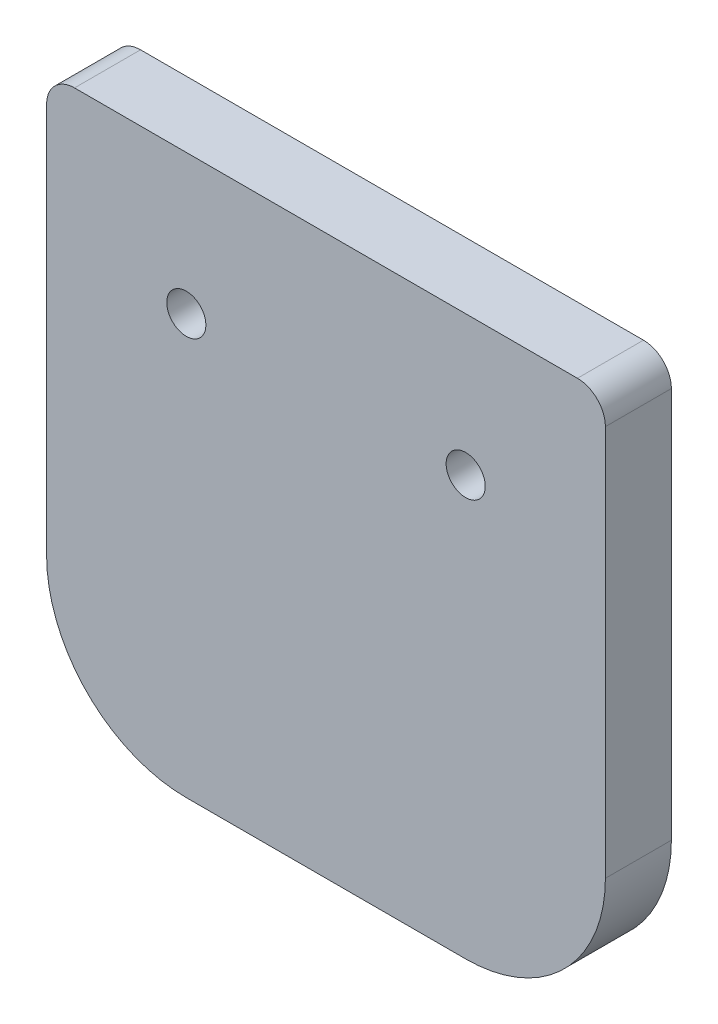
ISO-10303-21;
HEADER;
FILE_DESCRIPTION(('STEP AP214'),'2;1');
FILE_NAME('part.step','',(''),(''),'','','');
FILE_SCHEMA(('AUTOMOTIVE_DESIGN { 1 0 10303 214 1 1 1 1 }'));
ENDSEC;
DATA;
#1=APPLICATION_CONTEXT('core data for automotive mechanical design processes');
#2=APPLICATION_PROTOCOL_DEFINITION('international standard','automotive_design',2000,#1);
#3=PRODUCT_CONTEXT('',#1,'mechanical');
#4=PRODUCT('Part','Part','',(#3));
#5=PRODUCT_RELATED_PRODUCT_CATEGORY('part','',(#4));
#6=PRODUCT_DEFINITION_FORMATION('','',#4);
#7=PRODUCT_DEFINITION_CONTEXT('part definition',#1,'design');
#8=PRODUCT_DEFINITION('design','',#6,#7);
#9=PRODUCT_DEFINITION_SHAPE('','',#8);
#10=(LENGTH_UNIT() NAMED_UNIT(*) SI_UNIT(.MILLI.,.METRE.));
#11=(NAMED_UNIT(*) PLANE_ANGLE_UNIT() SI_UNIT($,.RADIAN.));
#12=(NAMED_UNIT(*) SI_UNIT($,.STERADIAN.) SOLID_ANGLE_UNIT());
#13=UNCERTAINTY_MEASURE_WITH_UNIT(LENGTH_MEASURE(1.E-05),#10,'distance_accuracy_value','');
#14=(GEOMETRIC_REPRESENTATION_CONTEXT(3) GLOBAL_UNCERTAINTY_ASSIGNED_CONTEXT((#13)) GLOBAL_UNIT_ASSIGNED_CONTEXT((#10,
#11,#12)) REPRESENTATION_CONTEXT('',''));
#15=CARTESIAN_POINT('',(0.,0.,0.));
#16=DIRECTION('',(0.,0.,1.));
#17=DIRECTION('',(1.,0.,0.));
#18=AXIS2_PLACEMENT_3D('',#15,#16,#17);
#19=CARTESIAN_POINT('',(25.4,22.86,0.));
#20=DIRECTION('',(-1.,0.,0.));
#21=DIRECTION('',(0.,-1.,0.));
#22=AXIS2_PLACEMENT_3D('',#19,#20,#21);
#23=PLANE('',#22);
#24=DIRECTION('',(0.,0.,1.));
#25=VECTOR('',#24,1.);
#26=CARTESIAN_POINT('',(25.4,-12.7000000052096,3.));
#27=LINE('',#26,#25);
#28=CARTESIAN_POINT('',(25.4,-12.7000000026048,6.));
#29=VERTEX_POINT('',#28);
#30=CARTESIAN_POINT('',(25.4,-12.7000000026048,0.));
#31=VERTEX_POINT('',#30);
#32=EDGE_CURVE('E111',#29,#31,#27,.F.);
#33=ORIENTED_EDGE('',*,*,#32,.T.);
#34=DIRECTION('',(0.,1.,0.));
#35=VECTOR('',#34,1.);
#36=CARTESIAN_POINT('',(25.4,0.,0.));
#37=LINE('',#36,#35);
#38=CARTESIAN_POINT('',(25.4,22.859999999479,0.));
#39=VERTEX_POINT('',#38);
#40=EDGE_CURVE('E106',#31,#39,#37,.T.);
#41=ORIENTED_EDGE('',*,*,#40,.T.);
#42=DIRECTION('',(0.,0.,-1.));
#43=VECTOR('',#42,1.);
#44=CARTESIAN_POINT('',(25.4,22.8599999989581,3.));
#45=LINE('',#44,#43);
#46=CARTESIAN_POINT('',(25.4,22.859999999479,6.));
#47=VERTEX_POINT('',#46);
#48=EDGE_CURVE('E81',#39,#47,#45,.F.);
#49=ORIENTED_EDGE('',*,*,#48,.T.);
#50=DIRECTION('',(0.,1.,0.));
#51=VECTOR('',#50,1.);
#52=CARTESIAN_POINT('',(25.4,0.,6.));
#53=LINE('',#52,#51);
#54=EDGE_CURVE('E139',#29,#47,#53,.T.);
#55=ORIENTED_EDGE('',*,*,#54,.F.);
#56=EDGE_LOOP('',(#33,#41,#49,#55));
#57=FACE_BOUND('',#56,.T.);
#58=ADVANCED_FACE('F17',(#57),#23,.F.);
#59=CARTESIAN_POINT('',(22.86,22.86,6.));
#60=DIRECTION('',(0.,0.,-1.));
#61=DIRECTION('',(-1.,0.,0.));
#62=AXIS2_PLACEMENT_3D('',#59,#60,#61);
#63=CYLINDRICAL_SURFACE('',#62,2.54);
#64=CARTESIAN_POINT('',(22.86,22.86,0.));
#65=DIRECTION('',(0.,0.,-1.));
#66=DIRECTION('',(-1.,0.,0.));
#67=AXIS2_PLACEMENT_3D('',#64,#65,#66);
#68=CIRCLE('',#67,2.54);
#69=CARTESIAN_POINT('',(22.86,25.4,0.));
#70=VERTEX_POINT('',#69);
#71=EDGE_CURVE('E21',#39,#70,#68,.F.);
#72=ORIENTED_EDGE('',*,*,#71,.T.);
#73=DIRECTION('',(0.,0.,1.));
#74=VECTOR('',#73,1.);
#75=CARTESIAN_POINT('',(22.86,25.4,3.));
#76=LINE('',#75,#74);
#77=CARTESIAN_POINT('',(22.86,25.4,6.));
#78=VERTEX_POINT('',#77);
#79=EDGE_CURVE('E88',#70,#78,#76,.T.);
#80=ORIENTED_EDGE('',*,*,#79,.T.);
#81=CARTESIAN_POINT('',(22.86,22.86,6.));
#82=DIRECTION('',(0.,0.,-1.));
#83=DIRECTION('',(-1.,0.,0.));
#84=AXIS2_PLACEMENT_3D('',#81,#82,#83);
#85=CIRCLE('',#84,2.54);
#86=EDGE_CURVE('E137',#47,#78,#85,.F.);
#87=ORIENTED_EDGE('',*,*,#86,.F.);
#88=ORIENTED_EDGE('',*,*,#48,.F.);
#89=EDGE_LOOP('',(#72,#80,#87,#88));
#90=FACE_BOUND('',#89,.T.);
#91=ADVANCED_FACE('F105',(#90),#63,.T.);
#92=CARTESIAN_POINT('',(-22.86,25.4,0.));
#93=DIRECTION('',(0.,-1.,0.));
#94=DIRECTION('',(1.,0.,0.));
#95=AXIS2_PLACEMENT_3D('',#92,#93,#94);
#96=PLANE('',#95);
#97=ORIENTED_EDGE('',*,*,#79,.F.);
#98=DIRECTION('',(-1.,0.,0.));
#99=VECTOR('',#98,1.);
#100=CARTESIAN_POINT('',(0.,25.4,0.));
#101=LINE('',#100,#99);
#102=CARTESIAN_POINT('',(-22.8599999997395,25.4,0.));
#103=VERTEX_POINT('',#102);
#104=EDGE_CURVE('E92',#70,#103,#101,.T.);
#105=ORIENTED_EDGE('',*,*,#104,.T.);
#106=DIRECTION('',(0.,0.,-1.));
#107=VECTOR('',#106,1.);
#108=CARTESIAN_POINT('',(-22.859999999479,25.4,3.));
#109=LINE('',#108,#107);
#110=CARTESIAN_POINT('',(-22.8599999997395,25.4,6.));
#111=VERTEX_POINT('',#110);
#112=EDGE_CURVE('E94',#103,#111,#109,.F.);
#113=ORIENTED_EDGE('',*,*,#112,.T.);
#114=DIRECTION('',(-1.,0.,0.));
#115=VECTOR('',#114,1.);
#116=CARTESIAN_POINT('',(0.,25.4,6.));
#117=LINE('',#116,#115);
#118=EDGE_CURVE('E93',#78,#111,#117,.T.);
#119=ORIENTED_EDGE('',*,*,#118,.F.);
#120=EDGE_LOOP('',(#97,#105,#113,#119));
#121=FACE_BOUND('',#120,.T.);
#122=ADVANCED_FACE('F90',(#121),#96,.F.);
#123=CARTESIAN_POINT('',(-22.86,22.86,6.));
#124=DIRECTION('',(0.,0.,-1.));
#125=DIRECTION('',(-1.,0.,0.));
#126=AXIS2_PLACEMENT_3D('',#123,#124,#125);
#127=CYLINDRICAL_SURFACE('',#126,2.54);
#128=CARTESIAN_POINT('',(-22.86,22.86,0.));
#129=DIRECTION('',(0.,0.,-1.));
#130=DIRECTION('',(-1.,0.,0.));
#131=AXIS2_PLACEMENT_3D('',#128,#129,#130);
#132=CIRCLE('',#131,2.54);
#133=CARTESIAN_POINT('',(-25.4,22.86,0.));
#134=VERTEX_POINT('',#133);
#135=EDGE_CURVE('E103',#103,#134,#132,.F.);
#136=ORIENTED_EDGE('',*,*,#135,.T.);
#137=DIRECTION('',(0.,0.,-1.));
#138=VECTOR('',#137,1.);
#139=CARTESIAN_POINT('',(-25.4,22.86,3.));
#140=LINE('',#139,#138);
#141=CARTESIAN_POINT('',(-25.4,22.86,6.));
#142=VERTEX_POINT('',#141);
#143=EDGE_CURVE('E121',#142,#134,#140,.T.);
#144=ORIENTED_EDGE('',*,*,#143,.F.);
#145=CARTESIAN_POINT('',(-22.86,22.86,6.));
#146=DIRECTION('',(0.,0.,-1.));
#147=DIRECTION('',(-1.,0.,0.));
#148=AXIS2_PLACEMENT_3D('',#145,#146,#147);
#149=CIRCLE('',#148,2.54);
#150=EDGE_CURVE('E135',#111,#142,#149,.F.);
#151=ORIENTED_EDGE('',*,*,#150,.F.);
#152=ORIENTED_EDGE('',*,*,#112,.F.);
#153=EDGE_LOOP('',(#136,#144,#151,#152));
#154=FACE_BOUND('',#153,.T.);
#155=ADVANCED_FACE('F175',(#154),#127,.T.);
#156=CARTESIAN_POINT('',(-25.4,22.86,0.));
#157=DIRECTION('',(-1.,0.,0.));
#158=DIRECTION('',(0.,-1.,0.));
#159=AXIS2_PLACEMENT_3D('',#156,#157,#158);
#160=PLANE('',#159);
#161=DIRECTION('',(0.,0.,-1.));
#162=VECTOR('',#161,1.);
#163=CARTESIAN_POINT('',(-25.4,-12.7000000022808,3.));
#164=LINE('',#163,#162);
#165=CARTESIAN_POINT('',(-25.4,-12.7000000011404,0.));
#166=VERTEX_POINT('',#165);
#167=CARTESIAN_POINT('',(-25.4,-12.7000000011404,6.));
#168=VERTEX_POINT('',#167);
#169=EDGE_CURVE('E118',#166,#168,#164,.F.);
#170=ORIENTED_EDGE('',*,*,#169,.T.);
#171=DIRECTION('',(0.,-1.,0.));
#172=VECTOR('',#171,1.);
#173=CARTESIAN_POINT('',(-25.4,0.,6.));
#174=LINE('',#173,#172);
#175=EDGE_CURVE('E134',#142,#168,#174,.T.);
#176=ORIENTED_EDGE('',*,*,#175,.F.);
#177=ORIENTED_EDGE('',*,*,#143,.T.);
#178=DIRECTION('',(0.,-1.,0.));
#179=VECTOR('',#178,1.);
#180=CARTESIAN_POINT('',(-25.4,0.,0.));
#181=LINE('',#180,#179);
#182=EDGE_CURVE('E149',#134,#166,#181,.T.);
#183=ORIENTED_EDGE('',*,*,#182,.T.);
#184=EDGE_LOOP('',(#170,#176,#177,#183));
#185=FACE_BOUND('',#184,.T.);
#186=ADVANCED_FACE('F164',(#185),#160,.T.);
#187=CARTESIAN_POINT('',(-12.7,-12.7,6.));
#188=DIRECTION('',(0.,0.,-1.));
#189=DIRECTION('',(-1.,0.,0.));
#190=AXIS2_PLACEMENT_3D('',#187,#188,#189);
#191=CYLINDRICAL_SURFACE('',#190,12.7);
#192=CARTESIAN_POINT('',(-12.7,-12.7,0.));
#193=DIRECTION('',(0.,0.,-1.));
#194=DIRECTION('',(-1.,0.,0.));
#195=AXIS2_PLACEMENT_3D('',#192,#193,#194);
#196=CIRCLE('',#195,12.7);
#197=CARTESIAN_POINT('',(-12.7,-25.4,0.));
#198=VERTEX_POINT('',#197);
#199=EDGE_CURVE('E147',#166,#198,#196,.F.);
#200=ORIENTED_EDGE('',*,*,#199,.T.);
#201=DIRECTION('',(0.,0.,-1.));
#202=VECTOR('',#201,1.);
#203=CARTESIAN_POINT('',(-12.7,-25.4,3.));
#204=LINE('',#203,#202);
#205=CARTESIAN_POINT('',(-12.7,-25.4,6.));
#206=VERTEX_POINT('',#205);
#207=EDGE_CURVE('E116',#206,#198,#204,.T.);
#208=ORIENTED_EDGE('',*,*,#207,.F.);
#209=CARTESIAN_POINT('',(-12.7,-12.7,6.));
#210=DIRECTION('',(0.,0.,-1.));
#211=DIRECTION('',(-1.,0.,0.));
#212=AXIS2_PLACEMENT_3D('',#209,#210,#211);
#213=CIRCLE('',#212,12.7);
#214=EDGE_CURVE('E132',#168,#206,#213,.F.);
#215=ORIENTED_EDGE('',*,*,#214,.F.);
#216=ORIENTED_EDGE('',*,*,#169,.F.);
#217=EDGE_LOOP('',(#200,#208,#215,#216));
#218=FACE_BOUND('',#217,.T.);
#219=ADVANCED_FACE('F167',(#218),#191,.T.);
#220=CARTESIAN_POINT('',(-12.7,-25.4,0.));
#221=DIRECTION('',(0.,-1.,0.));
#222=DIRECTION('',(1.,0.,0.));
#223=AXIS2_PLACEMENT_3D('',#220,#221,#222);
#224=PLANE('',#223);
#225=DIRECTION('',(0.,0.,-1.));
#226=VECTOR('',#225,1.);
#227=CARTESIAN_POINT('',(12.7000000048856,-25.4,3.));
#228=LINE('',#227,#226);
#229=CARTESIAN_POINT('',(12.7000000024428,-25.4,0.));
#230=VERTEX_POINT('',#229);
#231=CARTESIAN_POINT('',(12.7000000024428,-25.4,6.));
#232=VERTEX_POINT('',#231);
#233=EDGE_CURVE('E107',#230,#232,#228,.F.);
#234=ORIENTED_EDGE('',*,*,#233,.T.);
#235=DIRECTION('',(1.,0.,0.));
#236=VECTOR('',#235,1.);
#237=CARTESIAN_POINT('',(0.,-25.4,6.));
#238=LINE('',#237,#236);
#239=EDGE_CURVE('E36',#206,#232,#238,.T.);
#240=ORIENTED_EDGE('',*,*,#239,.F.);
#241=ORIENTED_EDGE('',*,*,#207,.T.);
#242=DIRECTION('',(1.,0.,0.));
#243=VECTOR('',#242,1.);
#244=CARTESIAN_POINT('',(0.,-25.4,0.));
#245=LINE('',#244,#243);
#246=EDGE_CURVE('E146',#198,#230,#245,.T.);
#247=ORIENTED_EDGE('',*,*,#246,.T.);
#248=EDGE_LOOP('',(#234,#240,#241,#247));
#249=FACE_BOUND('',#248,.T.);
#250=ADVANCED_FACE('F169',(#249),#224,.T.);
#251=CARTESIAN_POINT('',(12.7,-12.7,6.));
#252=DIRECTION('',(0.,0.,-1.));
#253=DIRECTION('',(-1.,0.,0.));
#254=AXIS2_PLACEMENT_3D('',#251,#252,#253);
#255=CYLINDRICAL_SURFACE('',#254,12.7);
#256=CARTESIAN_POINT('',(12.7,-12.7,0.));
#257=DIRECTION('',(0.,0.,-1.));
#258=DIRECTION('',(-1.,0.,0.));
#259=AXIS2_PLACEMENT_3D('',#256,#257,#258);
#260=CIRCLE('',#259,12.7);
#261=EDGE_CURVE('E143',#230,#31,#260,.F.);
#262=ORIENTED_EDGE('',*,*,#261,.T.);
#263=ORIENTED_EDGE('',*,*,#32,.F.);
#264=CARTESIAN_POINT('',(12.7,-12.7,6.));
#265=DIRECTION('',(0.,0.,-1.));
#266=DIRECTION('',(-1.,0.,0.));
#267=AXIS2_PLACEMENT_3D('',#264,#265,#266);
#268=CIRCLE('',#267,12.7);
#269=EDGE_CURVE('E130',#232,#29,#268,.F.);
#270=ORIENTED_EDGE('',*,*,#269,.F.);
#271=ORIENTED_EDGE('',*,*,#233,.F.);
#272=EDGE_LOOP('',(#262,#263,#270,#271));
#273=FACE_BOUND('',#272,.T.);
#274=ADVANCED_FACE('F173',(#273),#255,.T.);
#275=CARTESIAN_POINT('',(12.7,12.7,0.));
#276=DIRECTION('',(0.,0.,1.));
#277=DIRECTION('',(1.,0.,0.));
#278=AXIS2_PLACEMENT_3D('',#275,#276,#277);
#279=CYLINDRICAL_SURFACE('',#278,1.778);
#280=CARTESIAN_POINT('',(12.7,12.7,0.));
#281=DIRECTION('',(0.,0.,1.));
#282=DIRECTION('',(1.,0.,0.));
#283=AXIS2_PLACEMENT_3D('',#280,#281,#282);
#284=CIRCLE('',#283,1.778);
#285=CARTESIAN_POINT('',(14.478,12.7,0.));
#286=VERTEX_POINT('',#285);
#287=EDGE_CURVE('E140',#286,#286,#284,.F.);
#288=ORIENTED_EDGE('',*,*,#287,.T.);
#289=EDGE_LOOP('',(#288));
#290=FACE_BOUND('',#289,.T.);
#291=CARTESIAN_POINT('',(12.7,12.7,6.));
#292=DIRECTION('',(0.,0.,1.));
#293=DIRECTION('',(1.,0.,0.));
#294=AXIS2_PLACEMENT_3D('',#291,#292,#293);
#295=CIRCLE('',#294,1.778);
#296=CARTESIAN_POINT('',(14.478,12.7,6.));
#297=VERTEX_POINT('',#296);
#298=EDGE_CURVE('E127',#297,#297,#295,.F.);
#299=ORIENTED_EDGE('',*,*,#298,.F.);
#300=EDGE_LOOP('',(#299));
#301=FACE_BOUND('',#300,.T.);
#302=ADVANCED_FACE('F197',(#290,#301),#279,.F.);
#303=CARTESIAN_POINT('',(-25.4,-25.4,0.));
#304=DIRECTION('',(0.,0.,1.));
#305=DIRECTION('',(1.,0.,0.));
#306=AXIS2_PLACEMENT_3D('',#303,#304,#305);
#307=PLANE('',#306);
#308=ORIENTED_EDGE('',*,*,#287,.F.);
#309=EDGE_LOOP('',(#308));
#310=FACE_BOUND('',#309,.T.);
#311=CARTESIAN_POINT('',(-12.7,12.7,0.));
#312=DIRECTION('',(0.,0.,1.));
#313=DIRECTION('',(1.,0.,0.));
#314=AXIS2_PLACEMENT_3D('',#311,#312,#313);
#315=CIRCLE('',#314,1.778);
#316=CARTESIAN_POINT('',(-10.922,12.7,0.));
#317=VERTEX_POINT('',#316);
#318=EDGE_CURVE('E27',#317,#317,#315,.F.);
#319=ORIENTED_EDGE('',*,*,#318,.F.);
#320=EDGE_LOOP('',(#319));
#321=FACE_BOUND('',#320,.T.);
#322=ORIENTED_EDGE('',*,*,#246,.F.);
#323=ORIENTED_EDGE('',*,*,#199,.F.);
#324=ORIENTED_EDGE('',*,*,#182,.F.);
#325=ORIENTED_EDGE('',*,*,#135,.F.);
#326=ORIENTED_EDGE('',*,*,#104,.F.);
#327=ORIENTED_EDGE('',*,*,#71,.F.);
#328=ORIENTED_EDGE('',*,*,#40,.F.);
#329=ORIENTED_EDGE('',*,*,#261,.F.);
#330=EDGE_LOOP('',(#322,#323,#324,#325,#326,#327,#328,#329));
#331=FACE_BOUND('',#330,.T.);
#332=ADVANCED_FACE('F99',(#310,#321,#331),#307,.F.);
#333=CARTESIAN_POINT('',(-25.4,-25.4,6.));
#334=DIRECTION('',(0.,0.,1.));
#335=DIRECTION('',(1.,0.,0.));
#336=AXIS2_PLACEMENT_3D('',#333,#334,#335);
#337=PLANE('',#336);
#338=ORIENTED_EDGE('',*,*,#298,.T.);
#339=EDGE_LOOP('',(#338));
#340=FACE_BOUND('',#339,.T.);
#341=CARTESIAN_POINT('',(-12.7,12.7,6.));
#342=DIRECTION('',(0.,0.,1.));
#343=DIRECTION('',(1.,0.,0.));
#344=AXIS2_PLACEMENT_3D('',#341,#342,#343);
#345=CIRCLE('',#344,1.778);
#346=CARTESIAN_POINT('',(-10.922,12.7,6.));
#347=VERTEX_POINT('',#346);
#348=EDGE_CURVE('E11',#347,#347,#345,.T.);
#349=ORIENTED_EDGE('',*,*,#348,.F.);
#350=EDGE_LOOP('',(#349));
#351=FACE_BOUND('',#350,.T.);
#352=ORIENTED_EDGE('',*,*,#239,.T.);
#353=ORIENTED_EDGE('',*,*,#269,.T.);
#354=ORIENTED_EDGE('',*,*,#54,.T.);
#355=ORIENTED_EDGE('',*,*,#86,.T.);
#356=ORIENTED_EDGE('',*,*,#118,.T.);
#357=ORIENTED_EDGE('',*,*,#150,.T.);
#358=ORIENTED_EDGE('',*,*,#175,.T.);
#359=ORIENTED_EDGE('',*,*,#214,.T.);
#360=EDGE_LOOP('',(#352,#353,#354,#355,#356,#357,#358,#359));
#361=FACE_BOUND('',#360,.T.);
#362=ADVANCED_FACE('F19',(#340,#351,#361),#337,.T.);
#363=CARTESIAN_POINT('',(-12.7,12.7,0.));
#364=DIRECTION('',(0.,0.,1.));
#365=DIRECTION('',(1.,0.,0.));
#366=AXIS2_PLACEMENT_3D('',#363,#364,#365);
#367=CYLINDRICAL_SURFACE('',#366,1.778);
#368=ORIENTED_EDGE('',*,*,#348,.T.);
#369=EDGE_LOOP('',(#368));
#370=FACE_BOUND('',#369,.T.);
#371=ORIENTED_EDGE('',*,*,#318,.T.);
#372=EDGE_LOOP('',(#371));
#373=FACE_BOUND('',#372,.T.);
#374=ADVANCED_FACE('F187',(#370,#373),#367,.F.);
#375=CLOSED_SHELL('',(#58,#91,#122,#155,#186,#219,#250,#274,#302,#332,#362,#374));
#376=MANIFOLD_SOLID_BREP('B1',#375);
#377=ADVANCED_BREP_SHAPE_REPRESENTATION('',(#18,#376),#14);
#378=SHAPE_DEFINITION_REPRESENTATION(#9,#377);
ENDSEC;
END-ISO-10303-21;
